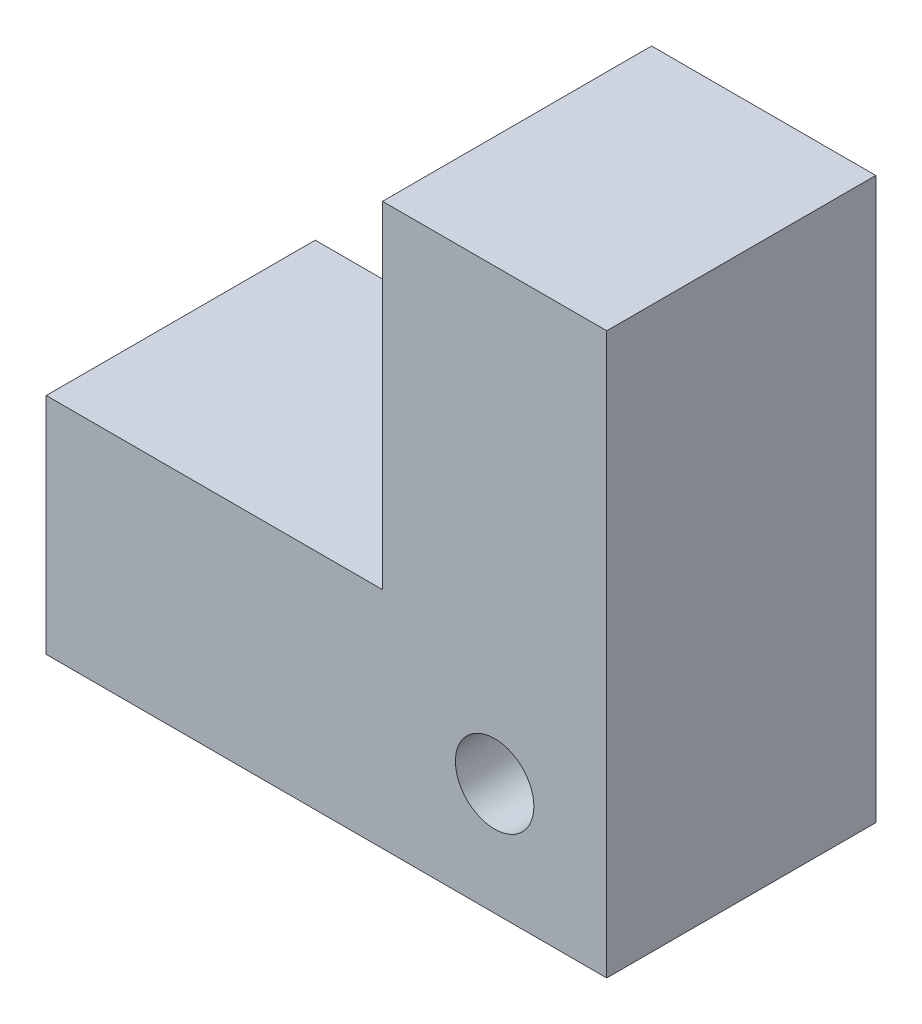
ISO-10303-21;
HEADER;
FILE_DESCRIPTION(('STEP AP214'),'2;1');
FILE_NAME('part.step','',(''),(''),'','','');
FILE_SCHEMA(('AUTOMOTIVE_DESIGN { 1 0 10303 214 1 1 1 1 }'));
ENDSEC;
DATA;
#1=APPLICATION_CONTEXT('core data for automotive mechanical design processes');
#2=APPLICATION_PROTOCOL_DEFINITION('international standard','automotive_design',2000,#1);
#3=PRODUCT_CONTEXT('',#1,'mechanical');
#4=PRODUCT('Part','Part','',(#3));
#5=PRODUCT_RELATED_PRODUCT_CATEGORY('part','',(#4));
#6=PRODUCT_DEFINITION_FORMATION('','',#4);
#7=PRODUCT_DEFINITION_CONTEXT('part definition',#1,'design');
#8=PRODUCT_DEFINITION('design','',#6,#7);
#9=PRODUCT_DEFINITION_SHAPE('','',#8);
#10=(LENGTH_UNIT() NAMED_UNIT(*) SI_UNIT(.MILLI.,.METRE.));
#11=(NAMED_UNIT(*) PLANE_ANGLE_UNIT() SI_UNIT($,.RADIAN.));
#12=(NAMED_UNIT(*) SI_UNIT($,.STERADIAN.) SOLID_ANGLE_UNIT());
#13=UNCERTAINTY_MEASURE_WITH_UNIT(LENGTH_MEASURE(1.E-05),#10,'distance_accuracy_value','');
#14=(GEOMETRIC_REPRESENTATION_CONTEXT(3) GLOBAL_UNCERTAINTY_ASSIGNED_CONTEXT((#13)) GLOBAL_UNIT_ASSIGNED_CONTEXT((#10,
#11,#12)) REPRESENTATION_CONTEXT('',''));
#15=CARTESIAN_POINT('',(0.,0.,0.));
#16=DIRECTION('',(0.,0.,1.));
#17=DIRECTION('',(1.,0.,0.));
#18=AXIS2_PLACEMENT_3D('',#15,#16,#17);
#19=CARTESIAN_POINT('',(-25.,0.,12.));
#20=DIRECTION('',(0.,1.,0.));
#21=DIRECTION('',(0.,0.,1.));
#22=AXIS2_PLACEMENT_3D('',#19,#20,#21);
#23=PLANE('',#22);
#24=DIRECTION('',(1.,0.,0.));
#25=VECTOR('',#24,1.);
#26=CARTESIAN_POINT('',(-25.,0.,0.));
#27=LINE('',#26,#25);
#28=CARTESIAN_POINT('',(-25.,0.,0.));
#29=VERTEX_POINT('',#28);
#30=CARTESIAN_POINT('',(0.,0.,0.));
#31=VERTEX_POINT('',#30);
#32=EDGE_CURVE('E120',#29,#31,#27,.T.);
#33=ORIENTED_EDGE('',*,*,#32,.T.);
#34=DIRECTION('',(0.,0.,-1.));
#35=VECTOR('',#34,1.);
#36=CARTESIAN_POINT('',(0.,0.,12.));
#37=LINE('',#36,#35);
#38=CARTESIAN_POINT('',(0.,0.,12.));
#39=VERTEX_POINT('',#38);
#40=EDGE_CURVE('E11',#39,#31,#37,.T.);
#41=ORIENTED_EDGE('',*,*,#40,.F.);
#42=DIRECTION('',(1.,0.,0.));
#43=VECTOR('',#42,1.);
#44=CARTESIAN_POINT('',(-25.,0.,12.));
#45=LINE('',#44,#43);
#46=CARTESIAN_POINT('',(-25.,0.,12.));
#47=VERTEX_POINT('',#46);
#48=EDGE_CURVE('E131',#47,#39,#45,.T.);
#49=ORIENTED_EDGE('',*,*,#48,.F.);
#50=DIRECTION('',(0.,0.,-1.));
#51=VECTOR('',#50,1.);
#52=CARTESIAN_POINT('',(-25.,0.,12.));
#53=LINE('',#52,#51);
#54=EDGE_CURVE('E116',#47,#29,#53,.T.);
#55=ORIENTED_EDGE('',*,*,#54,.T.);
#56=EDGE_LOOP('',(#33,#41,#49,#55));
#57=FACE_BOUND('',#56,.T.);
#58=ADVANCED_FACE('F36',(#57),#23,.F.);
#59=CARTESIAN_POINT('',(0.,0.,12.));
#60=DIRECTION('',(-1.,0.,0.));
#61=DIRECTION('',(0.,0.,1.));
#62=AXIS2_PLACEMENT_3D('',#59,#60,#61);
#63=PLANE('',#62);
#64=DIRECTION('',(0.,1.,0.));
#65=VECTOR('',#64,1.);
#66=CARTESIAN_POINT('',(0.,0.,0.));
#67=LINE('',#66,#65);
#68=CARTESIAN_POINT('',(0.,25.,0.));
#69=VERTEX_POINT('',#68);
#70=EDGE_CURVE('E123',#31,#69,#67,.T.);
#71=ORIENTED_EDGE('',*,*,#70,.T.);
#72=DIRECTION('',(0.,0.,-1.));
#73=VECTOR('',#72,1.);
#74=CARTESIAN_POINT('',(0.,25.,12.));
#75=LINE('',#74,#73);
#76=CARTESIAN_POINT('',(0.,25.,12.));
#77=VERTEX_POINT('',#76);
#78=EDGE_CURVE('E44',#77,#69,#75,.T.);
#79=ORIENTED_EDGE('',*,*,#78,.F.);
#80=DIRECTION('',(0.,1.,0.));
#81=VECTOR('',#80,1.);
#82=CARTESIAN_POINT('',(0.,0.,12.));
#83=LINE('',#82,#81);
#84=EDGE_CURVE('E89',#39,#77,#83,.T.);
#85=ORIENTED_EDGE('',*,*,#84,.F.);
#86=ORIENTED_EDGE('',*,*,#40,.T.);
#87=EDGE_LOOP('',(#71,#79,#85,#86));
#88=FACE_BOUND('',#87,.T.);
#89=ADVANCED_FACE('F157',(#88),#63,.F.);
#90=CARTESIAN_POINT('',(0.,25.,12.));
#91=DIRECTION('',(0.,-1.,0.));
#92=DIRECTION('',(0.,0.,-1.));
#93=AXIS2_PLACEMENT_3D('',#90,#91,#92);
#94=PLANE('',#93);
#95=DIRECTION('',(-1.,0.,0.));
#96=VECTOR('',#95,1.);
#97=CARTESIAN_POINT('',(0.,25.,0.));
#98=LINE('',#97,#96);
#99=CARTESIAN_POINT('',(-10.,25.,0.));
#100=VERTEX_POINT('',#99);
#101=EDGE_CURVE('E126',#69,#100,#98,.T.);
#102=ORIENTED_EDGE('',*,*,#101,.T.);
#103=DIRECTION('',(0.,0.,-1.));
#104=VECTOR('',#103,1.);
#105=CARTESIAN_POINT('',(-10.,25.,12.));
#106=LINE('',#105,#104);
#107=CARTESIAN_POINT('',(-10.,25.,12.));
#108=VERTEX_POINT('',#107);
#109=EDGE_CURVE('E111',#108,#100,#106,.T.);
#110=ORIENTED_EDGE('',*,*,#109,.F.);
#111=DIRECTION('',(-1.,0.,0.));
#112=VECTOR('',#111,1.);
#113=CARTESIAN_POINT('',(0.,25.,12.));
#114=LINE('',#113,#112);
#115=EDGE_CURVE('E102',#77,#108,#114,.T.);
#116=ORIENTED_EDGE('',*,*,#115,.F.);
#117=ORIENTED_EDGE('',*,*,#78,.T.);
#118=EDGE_LOOP('',(#102,#110,#116,#117));
#119=FACE_BOUND('',#118,.T.);
#120=ADVANCED_FACE('F137',(#119),#94,.F.);
#121=CARTESIAN_POINT('',(-10.,25.,12.));
#122=DIRECTION('',(1.,0.,0.));
#123=DIRECTION('',(0.,1.,0.));
#124=AXIS2_PLACEMENT_3D('',#121,#122,#123);
#125=PLANE('',#124);
#126=DIRECTION('',(0.,-1.,0.));
#127=VECTOR('',#126,1.);
#128=CARTESIAN_POINT('',(-10.,25.,0.));
#129=LINE('',#128,#127);
#130=CARTESIAN_POINT('',(-10.,10.,0.));
#131=VERTEX_POINT('',#130);
#132=EDGE_CURVE('E110',#100,#131,#129,.T.);
#133=ORIENTED_EDGE('',*,*,#132,.T.);
#134=DIRECTION('',(0.,0.,-1.));
#135=VECTOR('',#134,1.);
#136=CARTESIAN_POINT('',(-10.,10.,12.));
#137=LINE('',#136,#135);
#138=CARTESIAN_POINT('',(-10.,10.,12.));
#139=VERTEX_POINT('',#138);
#140=EDGE_CURVE('E107',#139,#131,#137,.T.);
#141=ORIENTED_EDGE('',*,*,#140,.F.);
#142=DIRECTION('',(0.,-1.,0.));
#143=VECTOR('',#142,1.);
#144=CARTESIAN_POINT('',(-10.,25.,12.));
#145=LINE('',#144,#143);
#146=EDGE_CURVE('E96',#108,#139,#145,.T.);
#147=ORIENTED_EDGE('',*,*,#146,.F.);
#148=ORIENTED_EDGE('',*,*,#109,.T.);
#149=EDGE_LOOP('',(#133,#141,#147,#148));
#150=FACE_BOUND('',#149,.T.);
#151=ADVANCED_FACE('F108',(#150),#125,.F.);
#152=CARTESIAN_POINT('',(-10.,10.,12.));
#153=DIRECTION('',(0.,-1.,0.));
#154=DIRECTION('',(1.,0.,0.));
#155=AXIS2_PLACEMENT_3D('',#152,#153,#154);
#156=PLANE('',#155);
#157=DIRECTION('',(-1.,0.,0.));
#158=VECTOR('',#157,1.);
#159=CARTESIAN_POINT('',(-10.,10.,0.));
#160=LINE('',#159,#158);
#161=CARTESIAN_POINT('',(-25.,10.,0.));
#162=VERTEX_POINT('',#161);
#163=EDGE_CURVE('E75',#131,#162,#160,.T.);
#164=ORIENTED_EDGE('',*,*,#163,.T.);
#165=DIRECTION('',(0.,0.,-1.));
#166=VECTOR('',#165,1.);
#167=CARTESIAN_POINT('',(-25.,10.,12.));
#168=LINE('',#167,#166);
#169=CARTESIAN_POINT('',(-25.,10.,12.));
#170=VERTEX_POINT('',#169);
#171=EDGE_CURVE('E112',#170,#162,#168,.T.);
#172=ORIENTED_EDGE('',*,*,#171,.F.);
#173=DIRECTION('',(-1.,0.,0.));
#174=VECTOR('',#173,1.);
#175=CARTESIAN_POINT('',(-10.,10.,12.));
#176=LINE('',#175,#174);
#177=EDGE_CURVE('E100',#139,#170,#176,.T.);
#178=ORIENTED_EDGE('',*,*,#177,.F.);
#179=ORIENTED_EDGE('',*,*,#140,.T.);
#180=EDGE_LOOP('',(#164,#172,#178,#179));
#181=FACE_BOUND('',#180,.T.);
#182=ADVANCED_FACE('F114',(#181),#156,.F.);
#183=CARTESIAN_POINT('',(-25.,10.,12.));
#184=DIRECTION('',(1.,0.,0.));
#185=DIRECTION('',(0.,0.,-1.));
#186=AXIS2_PLACEMENT_3D('',#183,#184,#185);
#187=PLANE('',#186);
#188=DIRECTION('',(0.,-1.,0.));
#189=VECTOR('',#188,1.);
#190=CARTESIAN_POINT('',(-25.,10.,0.));
#191=LINE('',#190,#189);
#192=EDGE_CURVE('E81',#162,#29,#191,.T.);
#193=ORIENTED_EDGE('',*,*,#192,.T.);
#194=ORIENTED_EDGE('',*,*,#54,.F.);
#195=DIRECTION('',(0.,-1.,0.));
#196=VECTOR('',#195,1.);
#197=CARTESIAN_POINT('',(-25.,10.,12.));
#198=LINE('',#197,#196);
#199=EDGE_CURVE('E52',#170,#47,#198,.T.);
#200=ORIENTED_EDGE('',*,*,#199,.F.);
#201=ORIENTED_EDGE('',*,*,#171,.T.);
#202=EDGE_LOOP('',(#193,#194,#200,#201));
#203=FACE_BOUND('',#202,.T.);
#204=ADVANCED_FACE('F144',(#203),#187,.F.);
#205=CARTESIAN_POINT('',(0.,0.,12.));
#206=DIRECTION('',(0.,0.,1.));
#207=DIRECTION('',(1.,0.,0.));
#208=AXIS2_PLACEMENT_3D('',#205,#206,#207);
#209=PLANE('',#208);
#210=CARTESIAN_POINT('',(-5.00000000000002,5.,12.));
#211=DIRECTION('',(0.,0.,1.));
#212=DIRECTION('',(1.,0.,0.));
#213=AXIS2_PLACEMENT_3D('',#210,#211,#212);
#214=CIRCLE('',#213,1.75);
#215=CARTESIAN_POINT('',(-3.25000000000002,5.,12.));
#216=VERTEX_POINT('',#215);
#217=EDGE_CURVE('E243',#216,#216,#214,.T.);
#218=ORIENTED_EDGE('',*,*,#217,.F.);
#219=EDGE_LOOP('',(#218));
#220=FACE_BOUND('',#219,.T.);
#221=ORIENTED_EDGE('',*,*,#48,.T.);
#222=ORIENTED_EDGE('',*,*,#84,.T.);
#223=ORIENTED_EDGE('',*,*,#115,.T.);
#224=ORIENTED_EDGE('',*,*,#146,.T.);
#225=ORIENTED_EDGE('',*,*,#177,.T.);
#226=ORIENTED_EDGE('',*,*,#199,.T.);
#227=EDGE_LOOP('',(#221,#222,#223,#224,#225,#226));
#228=FACE_BOUND('',#227,.T.);
#229=ADVANCED_FACE('F98',(#220,#228),#209,.T.);
#230=CARTESIAN_POINT('',(0.,0.,0.));
#231=DIRECTION('',(0.,0.,1.));
#232=DIRECTION('',(1.,0.,0.));
#233=AXIS2_PLACEMENT_3D('',#230,#231,#232);
#234=PLANE('',#233);
#235=CARTESIAN_POINT('',(-5.00000000000002,5.,0.));
#236=DIRECTION('',(0.,0.,1.));
#237=DIRECTION('',(1.,0.,0.));
#238=AXIS2_PLACEMENT_3D('',#235,#236,#237);
#239=CIRCLE('',#238,1.75);
#240=CARTESIAN_POINT('',(-3.25000000000002,5.,0.));
#241=VERTEX_POINT('',#240);
#242=EDGE_CURVE('E124',#241,#241,#239,.T.);
#243=ORIENTED_EDGE('',*,*,#242,.T.);
#244=EDGE_LOOP('',(#243));
#245=FACE_BOUND('',#244,.T.);
#246=ORIENTED_EDGE('',*,*,#32,.F.);
#247=ORIENTED_EDGE('',*,*,#192,.F.);
#248=ORIENTED_EDGE('',*,*,#163,.F.);
#249=ORIENTED_EDGE('',*,*,#132,.F.);
#250=ORIENTED_EDGE('',*,*,#101,.F.);
#251=ORIENTED_EDGE('',*,*,#70,.F.);
#252=EDGE_LOOP('',(#246,#247,#248,#249,#250,#251));
#253=FACE_BOUND('',#252,.T.);
#254=ADVANCED_FACE('F140',(#245,#253),#234,.F.);
#255=CARTESIAN_POINT('',(-5.00000000000002,5.,0.));
#256=DIRECTION('',(0.,0.,1.));
#257=DIRECTION('',(1.,0.,0.));
#258=AXIS2_PLACEMENT_3D('',#255,#256,#257);
#259=CYLINDRICAL_SURFACE('',#258,1.75);
#260=ORIENTED_EDGE('',*,*,#242,.F.);
#261=EDGE_LOOP('',(#260));
#262=FACE_BOUND('',#261,.T.);
#263=ORIENTED_EDGE('',*,*,#217,.T.);
#264=EDGE_LOOP('',(#263));
#265=FACE_BOUND('',#264,.T.);
#266=ADVANCED_FACE('F192',(#262,#265),#259,.F.);
#267=CLOSED_SHELL('',(#58,#89,#120,#151,#182,#204,#229,#254,#266));
#268=MANIFOLD_SOLID_BREP('B2',#267);
#269=ADVANCED_BREP_SHAPE_REPRESENTATION('',(#18,#268),#14);
#270=SHAPE_DEFINITION_REPRESENTATION(#9,#269);
ENDSEC;
END-ISO-10303-21;
